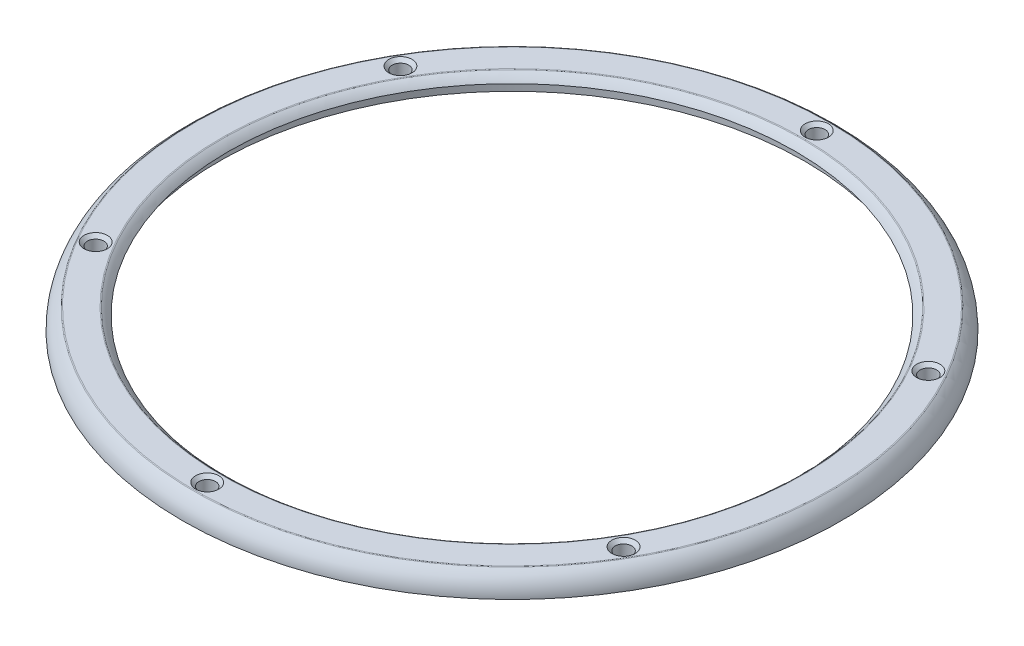
ISO-10303-21;
HEADER;
FILE_DESCRIPTION(('STEP AP214'),'2;1');
FILE_NAME('part.step','',(''),(''),'','','');
FILE_SCHEMA(('AUTOMOTIVE_DESIGN { 1 0 10303 214 1 1 1 1 }'));
ENDSEC;
DATA;
#1=APPLICATION_CONTEXT('core data for automotive mechanical design processes');
#2=APPLICATION_PROTOCOL_DEFINITION('international standard','automotive_design',2000,#1);
#3=PRODUCT_CONTEXT('',#1,'mechanical');
#4=PRODUCT('Part','Part','',(#3));
#5=PRODUCT_RELATED_PRODUCT_CATEGORY('part','',(#4));
#6=PRODUCT_DEFINITION_FORMATION('','',#4);
#7=PRODUCT_DEFINITION_CONTEXT('part definition',#1,'design');
#8=PRODUCT_DEFINITION('design','',#6,#7);
#9=PRODUCT_DEFINITION_SHAPE('','',#8);
#10=(LENGTH_UNIT() NAMED_UNIT(*) SI_UNIT(.MILLI.,.METRE.));
#11=(NAMED_UNIT(*) PLANE_ANGLE_UNIT() SI_UNIT($,.RADIAN.));
#12=(NAMED_UNIT(*) SI_UNIT($,.STERADIAN.) SOLID_ANGLE_UNIT());
#13=UNCERTAINTY_MEASURE_WITH_UNIT(LENGTH_MEASURE(1.E-05),#10,'distance_accuracy_value','');
#14=(GEOMETRIC_REPRESENTATION_CONTEXT(3) GLOBAL_UNCERTAINTY_ASSIGNED_CONTEXT((#13)) GLOBAL_UNIT_ASSIGNED_CONTEXT((#10,
#11,#12)) REPRESENTATION_CONTEXT('',''));
#15=CARTESIAN_POINT('',(0.,0.,0.));
#16=DIRECTION('',(0.,0.,1.));
#17=DIRECTION('',(1.,0.,0.));
#18=AXIS2_PLACEMENT_3D('',#15,#16,#17);
#19=CARTESIAN_POINT('',(0.,1.25,19.1491561975889));
#20=DIRECTION('',(0.,-1.,0.));
#21=DIRECTION('',(0.,0.,-1.));
#22=AXIS2_PLACEMENT_3D('',#19,#20,#21);
#23=PLANE('',#22);
#24=CARTESIAN_POINT('',(0.,1.25,0.));
#25=DIRECTION('',(0.,-1.,0.));
#26=DIRECTION('',(0.,0.,-1.));
#27=AXIS2_PLACEMENT_3D('',#24,#25,#26);
#28=CIRCLE('',#27,17.5215640288664);
#29=CARTESIAN_POINT('',(0.,1.25,-17.5215640288664));
#30=VERTEX_POINT('',#29);
#31=EDGE_CURVE('E49',#30,#30,#28,.T.);
#32=ORIENTED_EDGE('',*,*,#31,.T.);
#33=EDGE_LOOP('',(#32));
#34=FACE_BOUND('',#33,.T.);
#35=CARTESIAN_POINT('',(0.,1.25,0.));
#36=DIRECTION('',(0.,-1.,0.));
#37=DIRECTION('',(0.,0.,-1.));
#38=AXIS2_PLACEMENT_3D('',#35,#36,#37);
#39=CIRCLE('',#38,19.1184359711336);
#40=CARTESIAN_POINT('',(0.,1.25,-19.1184359711336));
#41=VERTEX_POINT('',#40);
#42=EDGE_CURVE('E53',#41,#41,#39,.F.);
#43=ORIENTED_EDGE('',*,*,#42,.T.);
#44=EDGE_LOOP('',(#43));
#45=FACE_BOUND('',#44,.T.);
#46=CARTESIAN_POINT('',(-15.8742456513687,1.25,-9.16500000000019));
#47=DIRECTION('',(0.,-1.,0.));
#48=DIRECTION('',(0.,0.,-1.));
#49=AXIS2_PLACEMENT_3D('',#46,#47,#48);
#50=CIRCLE('',#49,0.700000000000014);
#51=CARTESIAN_POINT('',(-15.8742456513687,1.25,-9.8650000000002));
#52=VERTEX_POINT('',#51);
#53=EDGE_CURVE('E58',#52,#52,#50,.T.);
#54=ORIENTED_EDGE('',*,*,#53,.T.);
#55=EDGE_LOOP('',(#54));
#56=FACE_BOUND('',#55,.T.);
#57=CARTESIAN_POINT('',(-15.8742456513688,1.25,9.16499999999985));
#58=DIRECTION('',(0.,-1.,0.));
#59=DIRECTION('',(0.,0.,-1.));
#60=AXIS2_PLACEMENT_3D('',#57,#58,#59);
#61=CIRCLE('',#60,0.699999999999998);
#62=CARTESIAN_POINT('',(-15.8742456513688,1.25,8.46499999999985));
#63=VERTEX_POINT('',#62);
#64=EDGE_CURVE('E64',#63,#63,#61,.T.);
#65=ORIENTED_EDGE('',*,*,#64,.T.);
#66=EDGE_LOOP('',(#65));
#67=FACE_BOUND('',#66,.T.);
#68=CARTESIAN_POINT('',(0.,1.25,18.33));
#69=DIRECTION('',(0.,-1.,0.));
#70=DIRECTION('',(0.,0.,-1.));
#71=AXIS2_PLACEMENT_3D('',#68,#69,#70);
#72=CIRCLE('',#71,0.699999999999999);
#73=CARTESIAN_POINT('',(0.,1.25,17.63));
#74=VERTEX_POINT('',#73);
#75=EDGE_CURVE('E70',#74,#74,#72,.T.);
#76=ORIENTED_EDGE('',*,*,#75,.T.);
#77=EDGE_LOOP('',(#76));
#78=FACE_BOUND('',#77,.T.);
#79=CARTESIAN_POINT('',(15.8742456513687,1.25,9.16500000000007));
#80=DIRECTION('',(0.,-1.,0.));
#81=DIRECTION('',(0.,0.,-1.));
#82=AXIS2_PLACEMENT_3D('',#79,#80,#81);
#83=CIRCLE('',#82,0.700000000000007);
#84=CARTESIAN_POINT('',(15.8742456513687,1.25,8.46500000000007));
#85=VERTEX_POINT('',#84);
#86=EDGE_CURVE('E76',#85,#85,#83,.T.);
#87=ORIENTED_EDGE('',*,*,#86,.T.);
#88=EDGE_LOOP('',(#87));
#89=FACE_BOUND('',#88,.T.);
#90=CARTESIAN_POINT('',(15.8742456513688,1.25,-9.16499999999996));
#91=DIRECTION('',(0.,-1.,0.));
#92=DIRECTION('',(0.,0.,-1.));
#93=AXIS2_PLACEMENT_3D('',#90,#91,#92);
#94=CIRCLE('',#93,0.699999999999992);
#95=CARTESIAN_POINT('',(15.8742456513688,1.25,-9.86499999999996));
#96=VERTEX_POINT('',#95);
#97=EDGE_CURVE('E82',#96,#96,#94,.T.);
#98=ORIENTED_EDGE('',*,*,#97,.T.);
#99=EDGE_LOOP('',(#98));
#100=FACE_BOUND('',#99,.T.);
#101=CARTESIAN_POINT('',(0.,1.25,-18.33));
#102=DIRECTION('',(0.,-1.,0.));
#103=DIRECTION('',(0.,0.,-1.));
#104=AXIS2_PLACEMENT_3D('',#101,#102,#103);
#105=CIRCLE('',#104,0.699999999999999);
#106=CARTESIAN_POINT('',(0.,1.25,-19.03));
#107=VERTEX_POINT('',#106);
#108=EDGE_CURVE('E88',#107,#107,#105,.T.);
#109=ORIENTED_EDGE('',*,*,#108,.T.);
#110=EDGE_LOOP('',(#109));
#111=FACE_BOUND('',#110,.T.);
#112=ADVANCED_FACE('F38',(#34,#45,#56,#67,#78,#89,#100,#111),#23,.F.);
#113=CARTESIAN_POINT('',(0.,0.,17.62));
#114=DIRECTION('',(0.,1.,0.));
#115=DIRECTION('',(0.,0.,1.));
#116=AXIS2_PLACEMENT_3D('',#113,#114,#115);
#117=PLANE('',#116);
#118=CARTESIAN_POINT('',(-15.8742456513688,0.,9.16499999999985));
#119=DIRECTION('',(0.,1.,0.));
#120=DIRECTION('',(0.866025403784443,0.,-0.499999999999992));
#121=AXIS2_PLACEMENT_3D('',#118,#119,#120);
#122=CIRCLE('',#121,0.5);
#123=CARTESIAN_POINT('',(-15.4412329494766,0.,8.91499999999986));
#124=VERTEX_POINT('',#123);
#125=EDGE_CURVE('E118',#124,#124,#122,.T.);
#126=ORIENTED_EDGE('',*,*,#125,.T.);
#127=EDGE_LOOP('',(#126));
#128=FACE_BOUND('',#127,.T.);
#129=CARTESIAN_POINT('',(15.8742456513687,0.,9.16500000000007));
#130=DIRECTION('',(0.,1.,0.));
#131=DIRECTION('',(-0.866025403784436,0.,-0.500000000000004));
#132=AXIS2_PLACEMENT_3D('',#129,#130,#131);
#133=CIRCLE('',#132,0.5);
#134=CARTESIAN_POINT('',(15.4412329494765,0.,8.91500000000007));
#135=VERTEX_POINT('',#134);
#136=EDGE_CURVE('E112',#135,#135,#133,.T.);
#137=ORIENTED_EDGE('',*,*,#136,.T.);
#138=EDGE_LOOP('',(#137));
#139=FACE_BOUND('',#138,.T.);
#140=CARTESIAN_POINT('',(0.,0.,-18.33));
#141=DIRECTION('',(0.,1.,0.));
#142=DIRECTION('',(0.,0.,1.));
#143=AXIS2_PLACEMENT_3D('',#140,#141,#142);
#144=CIRCLE('',#143,0.5);
#145=CARTESIAN_POINT('',(0.,0.,-17.83));
#146=VERTEX_POINT('',#145);
#147=EDGE_CURVE('E106',#146,#146,#144,.T.);
#148=ORIENTED_EDGE('',*,*,#147,.T.);
#149=EDGE_LOOP('',(#148));
#150=FACE_BOUND('',#149,.T.);
#151=CARTESIAN_POINT('',(0.,0.,0.));
#152=DIRECTION('',(0.,-1.,0.));
#153=DIRECTION('',(0.,0.,-1.));
#154=AXIS2_PLACEMENT_3D('',#151,#152,#153);
#155=CIRCLE('',#154,17.62);
#156=CARTESIAN_POINT('',(0.,0.,-17.62));
#157=VERTEX_POINT('',#156);
#158=EDGE_CURVE('E97',#157,#157,#155,.T.);
#159=ORIENTED_EDGE('',*,*,#158,.F.);
#160=EDGE_LOOP('',(#159));
#161=FACE_BOUND('',#160,.T.);
#162=CARTESIAN_POINT('',(0.,0.,0.));
#163=DIRECTION('',(0.,-1.,0.));
#164=DIRECTION('',(0.,0.,-1.));
#165=AXIS2_PLACEMENT_3D('',#162,#163,#164);
#166=CIRCLE('',#165,19.82);
#167=CARTESIAN_POINT('',(0.,0.,-19.82));
#168=VERTEX_POINT('',#167);
#169=EDGE_CURVE('E94',#168,#168,#166,.T.);
#170=ORIENTED_EDGE('',*,*,#169,.T.);
#171=EDGE_LOOP('',(#170));
#172=FACE_BOUND('',#171,.T.);
#173=CARTESIAN_POINT('',(15.8742456513688,0.,-9.16499999999996));
#174=DIRECTION('',(0.,1.,0.));
#175=DIRECTION('',(-0.86602540378444,0.,0.499999999999998));
#176=AXIS2_PLACEMENT_3D('',#173,#174,#175);
#177=CIRCLE('',#176,0.5);
#178=CARTESIAN_POINT('',(15.4412329494766,0.,-8.91499999999997));
#179=VERTEX_POINT('',#178);
#180=EDGE_CURVE('E109',#179,#179,#177,.T.);
#181=ORIENTED_EDGE('',*,*,#180,.T.);
#182=EDGE_LOOP('',(#181));
#183=FACE_BOUND('',#182,.T.);
#184=CARTESIAN_POINT('',(0.,0.,18.33));
#185=DIRECTION('',(0.,1.,0.));
#186=DIRECTION('',(0.,0.,-1.));
#187=AXIS2_PLACEMENT_3D('',#184,#185,#186);
#188=CIRCLE('',#187,0.5);
#189=CARTESIAN_POINT('',(0.,0.,17.83));
#190=VERTEX_POINT('',#189);
#191=EDGE_CURVE('E115',#190,#190,#188,.T.);
#192=ORIENTED_EDGE('',*,*,#191,.T.);
#193=EDGE_LOOP('',(#192));
#194=FACE_BOUND('',#193,.T.);
#195=CARTESIAN_POINT('',(-15.8742456513687,0.,-9.16500000000019));
#196=DIRECTION('',(0.,1.,0.));
#197=DIRECTION('',(0.866025403784433,0.,0.50000000000001));
#198=AXIS2_PLACEMENT_3D('',#195,#196,#197);
#199=CIRCLE('',#198,0.5);
#200=CARTESIAN_POINT('',(-15.4412329494764,0.,-8.91500000000018));
#201=VERTEX_POINT('',#200);
#202=EDGE_CURVE('E121',#201,#201,#199,.T.);
#203=ORIENTED_EDGE('',*,*,#202,.T.);
#204=EDGE_LOOP('',(#203));
#205=FACE_BOUND('',#204,.T.);
#206=ADVANCED_FACE('F125',(#128,#139,#150,#161,#172,#183,#194,#205),#117,.F.);
#207=CARTESIAN_POINT('',(0.,0.,0.));
#208=DIRECTION('',(0.,-1.,0.));
#209=DIRECTION('',(0.,0.,-1.));
#210=AXIS2_PLACEMENT_3D('',#207,#208,#209);
#211=TOROIDAL_SURFACE('',#210,18.32,1.5);
#212=CARTESIAN_POINT('',(0.,1.23214285714288,0.));
#213=DIRECTION('',(0.,-1.,0.));
#214=DIRECTION('',(0.,0.,-1.));
#215=AXIS2_PLACEMENT_3D('',#212,#213,#214);
#216=CIRCLE('',#215,17.4645328880712);
#217=CARTESIAN_POINT('',(0.,1.23214285714288,-17.4645328880712));
#218=VERTEX_POINT('',#217);
#219=EDGE_CURVE('E45',#218,#218,#216,.F.);
#220=ORIENTED_EDGE('',*,*,#219,.T.);
#221=EDGE_LOOP('',(#220));
#222=FACE_BOUND('',#221,.T.);
#223=CARTESIAN_POINT('',(0.,0.799999999999997,0.));
#224=DIRECTION('',(0.,-1.,0.));
#225=DIRECTION('',(0.,0.,-1.));
#226=AXIS2_PLACEMENT_3D('',#223,#224,#225);
#227=CIRCLE('',#226,17.051142245955);
#228=CARTESIAN_POINT('',(0.,0.799999999999997,-17.051142245955));
#229=VERTEX_POINT('',#228);
#230=EDGE_CURVE('E103',#229,#229,#227,.T.);
#231=ORIENTED_EDGE('',*,*,#230,.T.);
#232=EDGE_LOOP('',(#231));
#233=FACE_BOUND('',#232,.T.);
#234=ADVANCED_FACE('F149',(#222,#233),#211,.T.);
#235=CARTESIAN_POINT('',(0.,0.,0.));
#236=DIRECTION('',(0.,-1.,0.));
#237=DIRECTION('',(0.,0.,-1.));
#238=AXIS2_PLACEMENT_3D('',#235,#236,#237);
#239=TOROIDAL_SURFACE('',#238,18.32,1.5);
#240=CARTESIAN_POINT('',(0.,1.23214285714274,0.));
#241=DIRECTION('',(0.,-1.,0.));
#242=DIRECTION('',(0.,0.,-1.));
#243=AXIS2_PLACEMENT_3D('',#240,#241,#242);
#244=CIRCLE('',#243,19.1754671119287);
#245=CARTESIAN_POINT('',(0.,1.23214285714274,-19.1754671119287));
#246=VERTEX_POINT('',#245);
#247=EDGE_CURVE('E10',#246,#246,#244,.T.);
#248=ORIENTED_EDGE('',*,*,#247,.T.);
#249=EDGE_LOOP('',(#248));
#250=FACE_BOUND('',#249,.T.);
#251=ORIENTED_EDGE('',*,*,#169,.F.);
#252=EDGE_LOOP('',(#251));
#253=FACE_BOUND('',#252,.T.);
#254=ADVANCED_FACE('F155',(#250,#253),#239,.T.);
#255=CARTESIAN_POINT('',(0.,0.,0.));
#256=DIRECTION('',(0.,-1.,0.));
#257=DIRECTION('',(0.,0.,-1.));
#258=AXIS2_PLACEMENT_3D('',#255,#256,#257);
#259=CYLINDRICAL_SURFACE('',#258,17.62);
#260=CARTESIAN_POINT('',(0.,0.799999999999998,0.));
#261=DIRECTION('',(0.,-1.,0.));
#262=DIRECTION('',(0.,0.,-1.));
#263=AXIS2_PLACEMENT_3D('',#260,#261,#262);
#264=CIRCLE('',#263,17.62);
#265=CARTESIAN_POINT('',(0.,0.799999999999998,-17.62));
#266=VERTEX_POINT('',#265);
#267=EDGE_CURVE('E100',#266,#266,#264,.T.);
#268=ORIENTED_EDGE('',*,*,#267,.F.);
#269=EDGE_LOOP('',(#268));
#270=FACE_BOUND('',#269,.T.);
#271=ORIENTED_EDGE('',*,*,#158,.T.);
#272=EDGE_LOOP('',(#271));
#273=FACE_BOUND('',#272,.T.);
#274=ADVANCED_FACE('F236',(#270,#273),#259,.F.);
#275=CARTESIAN_POINT('',(0.,0.799999999999997,17.051142245955));
#276=DIRECTION('',(0.,1.,0.));
#277=DIRECTION('',(0.,0.,1.));
#278=AXIS2_PLACEMENT_3D('',#275,#276,#277);
#279=PLANE('',#278);
#280=ORIENTED_EDGE('',*,*,#230,.F.);
#281=EDGE_LOOP('',(#280));
#282=FACE_BOUND('',#281,.T.);
#283=ORIENTED_EDGE('',*,*,#267,.T.);
#284=EDGE_LOOP('',(#283));
#285=FACE_BOUND('',#284,.T.);
#286=ADVANCED_FACE('F208',(#282,#285),#279,.F.);
#287=CARTESIAN_POINT('',(0.,1.25,-18.33));
#288=DIRECTION('',(0.,-1.,0.));
#289=DIRECTION('',(0.,0.,-1.));
#290=AXIS2_PLACEMENT_3D('',#287,#288,#289);
#291=CYLINDRICAL_SURFACE('',#290,0.5);
#292=CARTESIAN_POINT('',(0.,1.05,-18.33));
#293=DIRECTION('',(0.,-1.,0.));
#294=DIRECTION('',(0.,0.,-1.));
#295=AXIS2_PLACEMENT_3D('',#292,#293,#294);
#296=CIRCLE('',#295,0.5);
#297=CARTESIAN_POINT('',(0.,1.05,-18.83));
#298=VERTEX_POINT('',#297);
#299=EDGE_CURVE('E91',#298,#298,#296,.F.);
#300=ORIENTED_EDGE('',*,*,#299,.T.);
#301=EDGE_LOOP('',(#300));
#302=FACE_BOUND('',#301,.T.);
#303=ORIENTED_EDGE('',*,*,#147,.F.);
#304=EDGE_LOOP('',(#303));
#305=FACE_BOUND('',#304,.T.);
#306=ADVANCED_FACE('F161',(#302,#305),#291,.F.);
#307=CARTESIAN_POINT('',(0.,1.05,-18.33));
#308=DIRECTION('',(0.,1.,0.));
#309=DIRECTION('',(0.,0.,1.));
#310=AXIS2_PLACEMENT_3D('',#307,#308,#309);
#311=CONICAL_SURFACE('',#310,0.5,0.785398163397445);
#312=ORIENTED_EDGE('',*,*,#108,.F.);
#313=EDGE_LOOP('',(#312));
#314=FACE_BOUND('',#313,.T.);
#315=ORIENTED_EDGE('',*,*,#299,.F.);
#316=EDGE_LOOP('',(#315));
#317=FACE_BOUND('',#316,.T.);
#318=ADVANCED_FACE('F158',(#314,#317),#311,.F.);
#319=CARTESIAN_POINT('',(15.8742456513688,1.25,-9.16499999999996));
#320=DIRECTION('',(0.,-1.,0.));
#321=DIRECTION('',(0.,0.,-1.));
#322=AXIS2_PLACEMENT_3D('',#319,#320,#321);
#323=CYLINDRICAL_SURFACE('',#322,0.5);
#324=CARTESIAN_POINT('',(15.8742456513688,1.05000000000001,-9.16499999999996));
#325=DIRECTION('',(0.,-1.,0.));
#326=DIRECTION('',(0.,0.,-1.));
#327=AXIS2_PLACEMENT_3D('',#324,#325,#326);
#328=CIRCLE('',#327,0.5);
#329=CARTESIAN_POINT('',(15.8742456513688,1.05000000000001,-9.66499999999996));
#330=VERTEX_POINT('',#329);
#331=EDGE_CURVE('E85',#330,#330,#328,.F.);
#332=ORIENTED_EDGE('',*,*,#331,.T.);
#333=EDGE_LOOP('',(#332));
#334=FACE_BOUND('',#333,.T.);
#335=ORIENTED_EDGE('',*,*,#180,.F.);
#336=EDGE_LOOP('',(#335));
#337=FACE_BOUND('',#336,.T.);
#338=ADVANCED_FACE('F160',(#334,#337),#323,.F.);
#339=CARTESIAN_POINT('',(15.8742456513687,1.25,9.16500000000007));
#340=DIRECTION('',(0.,-1.,0.));
#341=DIRECTION('',(0.,0.,-1.));
#342=AXIS2_PLACEMENT_3D('',#339,#340,#341);
#343=CYLINDRICAL_SURFACE('',#342,0.5);
#344=CARTESIAN_POINT('',(15.8742456513687,1.04999999999999,9.16500000000007));
#345=DIRECTION('',(0.,-1.,0.));
#346=DIRECTION('',(0.,0.,-1.));
#347=AXIS2_PLACEMENT_3D('',#344,#345,#346);
#348=CIRCLE('',#347,0.5);
#349=CARTESIAN_POINT('',(15.8742456513687,1.04999999999999,8.66500000000007));
#350=VERTEX_POINT('',#349);
#351=EDGE_CURVE('E79',#350,#350,#348,.F.);
#352=ORIENTED_EDGE('',*,*,#351,.T.);
#353=EDGE_LOOP('',(#352));
#354=FACE_BOUND('',#353,.T.);
#355=ORIENTED_EDGE('',*,*,#136,.F.);
#356=EDGE_LOOP('',(#355));
#357=FACE_BOUND('',#356,.T.);
#358=ADVANCED_FACE('F222',(#354,#357),#343,.F.);
#359=CARTESIAN_POINT('',(0.,1.25,18.33));
#360=DIRECTION('',(0.,-1.,0.));
#361=DIRECTION('',(0.,0.,-1.));
#362=AXIS2_PLACEMENT_3D('',#359,#360,#361);
#363=CYLINDRICAL_SURFACE('',#362,0.5);
#364=CARTESIAN_POINT('',(0.,1.05,18.33));
#365=DIRECTION('',(0.,-1.,0.));
#366=DIRECTION('',(0.,0.,-1.));
#367=AXIS2_PLACEMENT_3D('',#364,#365,#366);
#368=CIRCLE('',#367,0.5);
#369=CARTESIAN_POINT('',(0.,1.05,17.83));
#370=VERTEX_POINT('',#369);
#371=EDGE_CURVE('E73',#370,#370,#368,.F.);
#372=ORIENTED_EDGE('',*,*,#371,.T.);
#373=EDGE_LOOP('',(#372));
#374=FACE_BOUND('',#373,.T.);
#375=ORIENTED_EDGE('',*,*,#191,.F.);
#376=EDGE_LOOP('',(#375));
#377=FACE_BOUND('',#376,.T.);
#378=ADVANCED_FACE('F140',(#374,#377),#363,.F.);
#379=CARTESIAN_POINT('',(-15.8742456513688,1.25,9.16499999999985));
#380=DIRECTION('',(0.,-1.,0.));
#381=DIRECTION('',(0.,0.,-1.));
#382=AXIS2_PLACEMENT_3D('',#379,#380,#381);
#383=CYLINDRICAL_SURFACE('',#382,0.5);
#384=CARTESIAN_POINT('',(-15.8742456513688,1.05,9.16499999999985));
#385=DIRECTION('',(0.,-1.,0.));
#386=DIRECTION('',(0.,0.,-1.));
#387=AXIS2_PLACEMENT_3D('',#384,#385,#386);
#388=CIRCLE('',#387,0.5);
#389=CARTESIAN_POINT('',(-15.8742456513688,1.05,8.66499999999985));
#390=VERTEX_POINT('',#389);
#391=EDGE_CURVE('E67',#390,#390,#388,.F.);
#392=ORIENTED_EDGE('',*,*,#391,.T.);
#393=EDGE_LOOP('',(#392));
#394=FACE_BOUND('',#393,.T.);
#395=ORIENTED_EDGE('',*,*,#125,.F.);
#396=EDGE_LOOP('',(#395));
#397=FACE_BOUND('',#396,.T.);
#398=ADVANCED_FACE('F130',(#394,#397),#383,.F.);
#399=CARTESIAN_POINT('',(-15.8742456513687,1.25,-9.16500000000019));
#400=DIRECTION('',(0.,-1.,0.));
#401=DIRECTION('',(0.,0.,-1.));
#402=AXIS2_PLACEMENT_3D('',#399,#400,#401);
#403=CYLINDRICAL_SURFACE('',#402,0.5);
#404=CARTESIAN_POINT('',(-15.8742456513687,1.04999999999998,-9.16500000000019));
#405=DIRECTION('',(0.,-1.,0.));
#406=DIRECTION('',(0.,0.,-1.));
#407=AXIS2_PLACEMENT_3D('',#404,#405,#406);
#408=CIRCLE('',#407,0.5);
#409=CARTESIAN_POINT('',(-15.8742456513687,1.04999999999998,-9.66500000000019));
#410=VERTEX_POINT('',#409);
#411=EDGE_CURVE('E61',#410,#410,#408,.F.);
#412=ORIENTED_EDGE('',*,*,#411,.T.);
#413=EDGE_LOOP('',(#412));
#414=FACE_BOUND('',#413,.T.);
#415=ORIENTED_EDGE('',*,*,#202,.F.);
#416=EDGE_LOOP('',(#415));
#417=FACE_BOUND('',#416,.T.);
#418=ADVANCED_FACE('F127',(#414,#417),#403,.F.);
#419=CARTESIAN_POINT('',(15.8742456513688,1.05000000000001,-9.16499999999996));
#420=DIRECTION('',(0.,1.,0.));
#421=DIRECTION('',(0.,0.,1.));
#422=AXIS2_PLACEMENT_3D('',#419,#420,#421);
#423=CONICAL_SURFACE('',#422,0.5,0.785398163397459);
#424=ORIENTED_EDGE('',*,*,#97,.F.);
#425=EDGE_LOOP('',(#424));
#426=FACE_BOUND('',#425,.T.);
#427=ORIENTED_EDGE('',*,*,#331,.F.);
#428=EDGE_LOOP('',(#427));
#429=FACE_BOUND('',#428,.T.);
#430=ADVANCED_FACE('F129',(#426,#429),#423,.F.);
#431=CARTESIAN_POINT('',(15.8742456513687,1.04999999999999,9.16500000000007));
#432=DIRECTION('',(0.,1.,0.));
#433=DIRECTION('',(0.,0.,1.));
#434=AXIS2_PLACEMENT_3D('',#431,#432,#433);
#435=CONICAL_SURFACE('',#434,0.5,0.785398163397447);
#436=ORIENTED_EDGE('',*,*,#86,.F.);
#437=EDGE_LOOP('',(#436));
#438=FACE_BOUND('',#437,.T.);
#439=ORIENTED_EDGE('',*,*,#351,.F.);
#440=EDGE_LOOP('',(#439));
#441=FACE_BOUND('',#440,.T.);
#442=ADVANCED_FACE('F137',(#438,#441),#435,.F.);
#443=CARTESIAN_POINT('',(0.,1.05,18.33));
#444=DIRECTION('',(0.,1.,0.));
#445=DIRECTION('',(0.,0.,1.));
#446=AXIS2_PLACEMENT_3D('',#443,#444,#445);
#447=CONICAL_SURFACE('',#446,0.5,0.785398163397445);
#448=ORIENTED_EDGE('',*,*,#75,.F.);
#449=EDGE_LOOP('',(#448));
#450=FACE_BOUND('',#449,.T.);
#451=ORIENTED_EDGE('',*,*,#371,.F.);
#452=EDGE_LOOP('',(#451));
#453=FACE_BOUND('',#452,.T.);
#454=ADVANCED_FACE('F166',(#450,#453),#447,.F.);
#455=CARTESIAN_POINT('',(-15.8742456513688,1.05,9.16499999999985));
#456=DIRECTION('',(0.,1.,0.));
#457=DIRECTION('',(0.,0.,1.));
#458=AXIS2_PLACEMENT_3D('',#455,#456,#457);
#459=CONICAL_SURFACE('',#458,0.5,0.785398163397459);
#460=ORIENTED_EDGE('',*,*,#64,.F.);
#461=EDGE_LOOP('',(#460));
#462=FACE_BOUND('',#461,.T.);
#463=ORIENTED_EDGE('',*,*,#391,.F.);
#464=EDGE_LOOP('',(#463));
#465=FACE_BOUND('',#464,.T.);
#466=ADVANCED_FACE('F170',(#462,#465),#459,.F.);
#467=CARTESIAN_POINT('',(-15.8742456513687,1.04999999999998,-9.16500000000019));
#468=DIRECTION('',(0.,1.,0.));
#469=DIRECTION('',(0.,0.,1.));
#470=AXIS2_PLACEMENT_3D('',#467,#468,#469);
#471=CONICAL_SURFACE('',#470,0.5,0.785398163397446);
#472=ORIENTED_EDGE('',*,*,#53,.F.);
#473=EDGE_LOOP('',(#472));
#474=FACE_BOUND('',#473,.T.);
#475=ORIENTED_EDGE('',*,*,#411,.F.);
#476=EDGE_LOOP('',(#475));
#477=FACE_BOUND('',#476,.T.);
#478=ADVANCED_FACE('F174',(#474,#477),#471,.F.);
#479=CARTESIAN_POINT('',(0.,1.15,0.));
#480=DIRECTION('',(0.,1.,0.));
#481=DIRECTION('',(0.,0.,1.));
#482=AXIS2_PLACEMENT_3D('',#479,#480,#481);
#483=TOROIDAL_SURFACE('',#482,17.5215640288664,0.1);
#484=ORIENTED_EDGE('',*,*,#219,.F.);
#485=EDGE_LOOP('',(#484));
#486=FACE_BOUND('',#485,.T.);
#487=ORIENTED_EDGE('',*,*,#31,.F.);
#488=EDGE_LOOP('',(#487));
#489=FACE_BOUND('',#488,.T.);
#490=ADVANCED_FACE('F177',(#486,#489),#483,.T.);
#491=CARTESIAN_POINT('',(0.,1.15,0.));
#492=DIRECTION('',(0.,-1.,0.));
#493=DIRECTION('',(0.,0.,-1.));
#494=AXIS2_PLACEMENT_3D('',#491,#492,#493);
#495=TOROIDAL_SURFACE('',#494,19.1184359711336,0.1);
#496=ORIENTED_EDGE('',*,*,#42,.F.);
#497=EDGE_LOOP('',(#496));
#498=FACE_BOUND('',#497,.T.);
#499=ORIENTED_EDGE('',*,*,#247,.F.);
#500=EDGE_LOOP('',(#499));
#501=FACE_BOUND('',#500,.T.);
#502=ADVANCED_FACE('F40',(#498,#501),#495,.T.);
#503=CLOSED_SHELL('',(#112,#206,#234,#254,#274,#286,#306,#318,#338,#358,#378,#398,#418,#430,
#442,#454,#466,#478,#490,#502));
#504=MANIFOLD_SOLID_BREP('B2',#503);
#505=ADVANCED_BREP_SHAPE_REPRESENTATION('',(#18,#504),#14);
#506=SHAPE_DEFINITION_REPRESENTATION(#9,#505);
ENDSEC;
END-ISO-10303-21;
